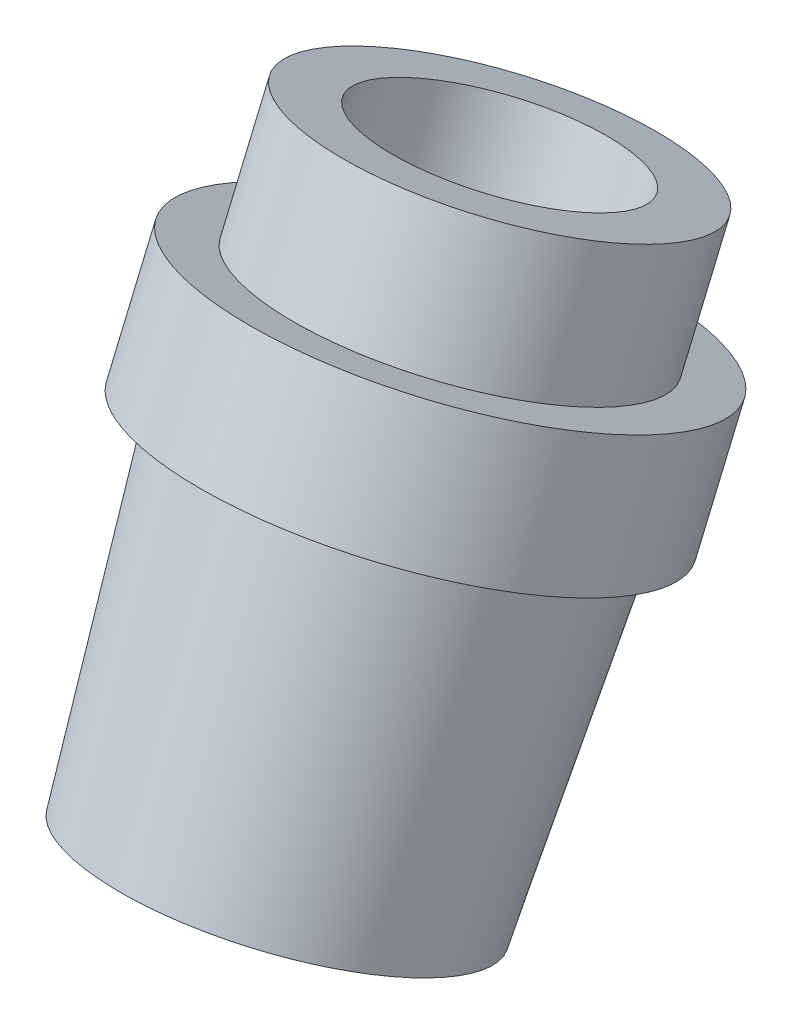
ISO-10303-21;
HEADER;
FILE_DESCRIPTION(('STEP AP214'),'2;1');
FILE_NAME('part.step','',(''),(''),'','','');
FILE_SCHEMA(('AUTOMOTIVE_DESIGN { 1 0 10303 214 1 1 1 1 }'));
ENDSEC;
DATA;
#1=APPLICATION_CONTEXT('core data for automotive mechanical design processes');
#2=APPLICATION_PROTOCOL_DEFINITION('international standard','automotive_design',2000,#1);
#3=PRODUCT_CONTEXT('',#1,'mechanical');
#4=PRODUCT('Part','Part','',(#3));
#5=PRODUCT_RELATED_PRODUCT_CATEGORY('part','',(#4));
#6=PRODUCT_DEFINITION_FORMATION('','',#4);
#7=PRODUCT_DEFINITION_CONTEXT('part definition',#1,'design');
#8=PRODUCT_DEFINITION('design','',#6,#7);
#9=PRODUCT_DEFINITION_SHAPE('','',#8);
#10=(LENGTH_UNIT() NAMED_UNIT(*) SI_UNIT(.MILLI.,.METRE.));
#11=(NAMED_UNIT(*) PLANE_ANGLE_UNIT() SI_UNIT($,.RADIAN.));
#12=(NAMED_UNIT(*) SI_UNIT($,.STERADIAN.) SOLID_ANGLE_UNIT());
#13=UNCERTAINTY_MEASURE_WITH_UNIT(LENGTH_MEASURE(1.E-05),#10,'distance_accuracy_value','');
#14=(GEOMETRIC_REPRESENTATION_CONTEXT(3) GLOBAL_UNCERTAINTY_ASSIGNED_CONTEXT((#13)) GLOBAL_UNIT_ASSIGNED_CONTEXT((#10,
#11,#12)) REPRESENTATION_CONTEXT('',''));
#15=CARTESIAN_POINT('',(0.,0.,0.));
#16=DIRECTION('',(0.,0.,1.));
#17=DIRECTION('',(1.,0.,0.));
#18=AXIS2_PLACEMENT_3D('',#15,#16,#17);
#19=CARTESIAN_POINT('',(-1.81784857534822E-12,-204.304483063694,348.49114350528));
#20=DIRECTION('',(0.,-0.920504853452441,0.390731128489271));
#21=DIRECTION('',(0.,-0.390731128489271,-0.920504853452441));
#22=AXIS2_PLACEMENT_3D('',#19,#20,#21);
#23=PLANE('',#22);
#24=CARTESIAN_POINT('',(-1.81784857534822E-12,-204.304483063694,348.49114350528));
#25=DIRECTION('',(0.,-0.920504853452441,0.390731128489271));
#26=DIRECTION('',(0.,-0.390731128489271,-0.920504853452441));
#27=AXIS2_PLACEMENT_3D('',#24,#25,#26);
#28=CIRCLE('',#27,34.3930374945528);
#29=CARTESIAN_POINT('',(-1.81784857534822E-12,-217.742913416114,316.832185566572));
#30=VERTEX_POINT('',#29);
#31=EDGE_CURVE('E58',#30,#30,#28,.T.);
#32=ORIENTED_EDGE('',*,*,#31,.T.);
#33=EDGE_LOOP('',(#32));
#34=FACE_BOUND('',#33,.T.);
#35=CARTESIAN_POINT('',(-1.81784857534822E-12,-204.304483063694,348.49114350528));
#36=DIRECTION('',(0.,-0.920504853452441,0.390731128489271));
#37=DIRECTION('',(0.,-0.390731128489271,-0.920504853452441));
#38=AXIS2_PLACEMENT_3D('',#35,#36,#37);
#39=CIRCLE('',#38,29.5134264587048);
#40=CARTESIAN_POINT('',(-1.81784857534822E-12,-215.836297489489,321.32389120803));
#41=VERTEX_POINT('',#40);
#42=EDGE_CURVE('E43',#41,#41,#39,.T.);
#43=ORIENTED_EDGE('',*,*,#42,.F.);
#44=EDGE_LOOP('',(#43));
#45=FACE_BOUND('',#44,.T.);
#46=ADVANCED_FACE('F39',(#34,#45),#23,.T.);
#47=CARTESIAN_POINT('',(-2.46797192531776E-12,-255.912584649944,370.39748294103));
#48=DIRECTION('',(0.,0.920504853452441,-0.390731128489271));
#49=DIRECTION('',(0.,0.390731128489271,0.920504853452441));
#50=AXIS2_PLACEMENT_3D('',#47,#48,#49);
#51=CYLINDRICAL_SURFACE('',#50,26.8930374945528);
#52=CARTESIAN_POINT('',(-1.35401310719827E-12,-167.484288925596,332.861898365709));
#53=DIRECTION('',(0.,-0.920504853452441,0.390731128489271));
#54=DIRECTION('',(0.,-0.390731128489271,-0.920504853452441));
#55=AXIS2_PLACEMENT_3D('',#52,#53,#54);
#56=CIRCLE('',#55,26.8930374945528);
#57=CARTESIAN_POINT('',(-1.35401310719827E-12,-177.992235814347,308.106726827895));
#58=VERTEX_POINT('',#57);
#59=EDGE_CURVE('E47',#58,#58,#56,.T.);
#60=ORIENTED_EDGE('',*,*,#59,.T.);
#61=EDGE_LOOP('',(#60));
#62=FACE_BOUND('',#61,.T.);
#63=CARTESIAN_POINT('',(-1.58593084127324E-12,-185.894385994645,340.676520935495));
#64=DIRECTION('',(0.,-0.920504853452441,0.390731128489271));
#65=DIRECTION('',(0.,-0.390731128489271,-0.920504853452441));
#66=AXIS2_PLACEMENT_3D('',#63,#64,#65);
#67=CIRCLE('',#66,26.8930374945528);
#68=CARTESIAN_POINT('',(-1.58593084127324E-12,-196.402332883396,315.92134939768));
#69=VERTEX_POINT('',#68);
#70=EDGE_CURVE('E10',#69,#69,#67,.T.);
#71=ORIENTED_EDGE('',*,*,#70,.F.);
#72=EDGE_LOOP('',(#71));
#73=FACE_BOUND('',#72,.T.);
#74=ADVANCED_FACE('F78',(#62,#73),#51,.T.);
#75=CARTESIAN_POINT('',(-1.35401310719827E-12,-167.484288925596,332.861898365709));
#76=DIRECTION('',(0.,-0.920504853452441,0.390731128489271));
#77=DIRECTION('',(0.,-0.390731128489271,-0.920504853452441));
#78=AXIS2_PLACEMENT_3D('',#75,#76,#77);
#79=PLANE('',#78);
#80=ORIENTED_EDGE('',*,*,#59,.F.);
#81=EDGE_LOOP('',(#80));
#82=FACE_BOUND('',#81,.T.);
#83=CARTESIAN_POINT('',(-1.35401310719827E-12,-167.484288925596,332.861898365709));
#84=DIRECTION('',(0.,-0.920504853452441,0.390731128489271));
#85=DIRECTION('',(0.,-0.390731128489271,-0.920504853452441));
#86=AXIS2_PLACEMENT_3D('',#83,#84,#85);
#87=CIRCLE('',#86,18.393037494553);
#88=CARTESIAN_POINT('',(-1.35401310719827E-12,-174.671021222188,315.93101808224));
#89=VERTEX_POINT('',#88);
#90=EDGE_CURVE('E52',#89,#89,#87,.T.);
#91=ORIENTED_EDGE('',*,*,#90,.T.);
#92=EDGE_LOOP('',(#91));
#93=FACE_BOUND('',#92,.T.);
#94=ADVANCED_FACE('F84',(#82,#93),#79,.F.);
#95=CARTESIAN_POINT('',(-2.46797192531776E-12,-255.912584649944,370.39748294103));
#96=DIRECTION('',(0.,0.920504853452441,-0.390731128489271));
#97=DIRECTION('',(0.,0.390731128489271,0.920504853452441));
#98=AXIS2_PLACEMENT_3D('',#95,#96,#97);
#99=CYLINDRICAL_SURFACE('',#98,18.393037494553);
#100=ORIENTED_EDGE('',*,*,#90,.F.);
#101=EDGE_LOOP('',(#100));
#102=FACE_BOUND('',#101,.T.);
#103=CARTESIAN_POINT('',(-2.39764291053566E-12,-250.329725736316,368.027699929744));
#104=DIRECTION('',(0.,-0.920504853452441,0.390731128489271));
#105=DIRECTION('',(0.,-0.390731128489271,-0.920504853452441));
#106=AXIS2_PLACEMENT_3D('',#103,#104,#105);
#107=CIRCLE('',#106,18.393037494553);
#108=CARTESIAN_POINT('',(-2.39764291053566E-12,-257.516458032908,351.096819646275));
#109=VERTEX_POINT('',#108);
#110=EDGE_CURVE('E69',#109,#109,#107,.T.);
#111=ORIENTED_EDGE('',*,*,#110,.T.);
#112=EDGE_LOOP('',(#111));
#113=FACE_BOUND('',#112,.T.);
#114=ADVANCED_FACE('F93',(#102,#113),#99,.F.);
#115=CARTESIAN_POINT('',(-1.58593084127324E-12,-185.894385994645,340.676520935495));
#116=DIRECTION('',(0.,-0.920504853452441,0.390731128489271));
#117=DIRECTION('',(0.,-0.390731128489271,-0.920504853452441));
#118=AXIS2_PLACEMENT_3D('',#115,#116,#117);
#119=PLANE('',#118);
#120=ORIENTED_EDGE('',*,*,#70,.T.);
#121=EDGE_LOOP('',(#120));
#122=FACE_BOUND('',#121,.T.);
#123=CARTESIAN_POINT('',(-1.58593084127324E-12,-185.894385994645,340.676520935495));
#124=DIRECTION('',(0.,-0.920504853452441,0.390731128489271));
#125=DIRECTION('',(0.,-0.390731128489271,-0.920504853452441));
#126=AXIS2_PLACEMENT_3D('',#123,#124,#125);
#127=CIRCLE('',#126,34.3930374945528);
#128=CARTESIAN_POINT('',(-1.58593084127324E-12,-199.332816347066,309.017562996787));
#129=VERTEX_POINT('',#128);
#130=EDGE_CURVE('E55',#129,#129,#127,.T.);
#131=ORIENTED_EDGE('',*,*,#130,.F.);
#132=EDGE_LOOP('',(#131));
#133=FACE_BOUND('',#132,.T.);
#134=ADVANCED_FACE('F89',(#122,#133),#119,.F.);
#135=CARTESIAN_POINT('',(-1.81784857534822E-12,-204.304483063694,348.49114350528));
#136=DIRECTION('',(0.,0.920504853452441,-0.390731128489271));
#137=DIRECTION('',(0.,0.390731128489271,0.920504853452441));
#138=AXIS2_PLACEMENT_3D('',#135,#136,#137);
#139=CYLINDRICAL_SURFACE('',#138,34.3930374945528);
#140=ORIENTED_EDGE('',*,*,#31,.F.);
#141=EDGE_LOOP('',(#140));
#142=FACE_BOUND('',#141,.T.);
#143=ORIENTED_EDGE('',*,*,#130,.T.);
#144=EDGE_LOOP('',(#143));
#145=FACE_BOUND('',#144,.T.);
#146=ADVANCED_FACE('F92',(#142,#145),#139,.T.);
#147=CARTESIAN_POINT('',(-2.39764291053566E-12,-250.329725736316,368.027699929744));
#148=DIRECTION('',(0.,-0.920504853452441,0.390731128489271));
#149=DIRECTION('',(0.,-0.390731128489271,-0.920504853452441));
#150=AXIS2_PLACEMENT_3D('',#147,#148,#149);
#151=PLANE('',#150);
#152=CARTESIAN_POINT('',(-2.39764291053566E-12,-250.329725736316,368.027699929744));
#153=DIRECTION('',(0.,-0.920504853452441,0.390731128489271));
#154=DIRECTION('',(0.,-0.390731128489271,-0.920504853452441));
#155=AXIS2_PLACEMENT_3D('',#152,#153,#154);
#156=CIRCLE('',#155,26.8930374945528);
#157=CARTESIAN_POINT('',(-2.39764291053566E-12,-260.837672625067,343.272528391929));
#158=VERTEX_POINT('',#157);
#159=EDGE_CURVE('E65',#158,#158,#156,.T.);
#160=ORIENTED_EDGE('',*,*,#159,.T.);
#161=EDGE_LOOP('',(#160));
#162=FACE_BOUND('',#161,.T.);
#163=ORIENTED_EDGE('',*,*,#110,.F.);
#164=EDGE_LOOP('',(#163));
#165=FACE_BOUND('',#164,.T.);
#166=ADVANCED_FACE('F88',(#162,#165),#151,.T.);
#167=CARTESIAN_POINT('',(-2.39764291053566E-12,-250.329725736316,368.027699929744));
#168=DIRECTION('',(0.,0.920504853452441,-0.390731128489271));
#169=DIRECTION('',(0.,-0.390731128489271,-0.920504853452441));
#170=AXIS2_PLACEMENT_3D('',#167,#168,#169);
#171=CONICAL_SURFACE('',#170,26.8930374945528,0.05235987755983);
#172=ORIENTED_EDGE('',*,*,#159,.F.);
#173=EDGE_LOOP('',(#172));
#174=FACE_BOUND('',#173,.T.);
#175=ORIENTED_EDGE('',*,*,#42,.T.);
#176=EDGE_LOOP('',(#175));
#177=FACE_BOUND('',#176,.T.);
#178=ADVANCED_FACE('F41',(#174,#177),#171,.T.);
#179=CLOSED_SHELL('',(#46,#74,#94,#114,#134,#146,#166,#178));
#180=MANIFOLD_SOLID_BREP('B2',#179);
#181=ADVANCED_BREP_SHAPE_REPRESENTATION('',(#18,#180),#14);
#182=SHAPE_DEFINITION_REPRESENTATION(#9,#181);
ENDSEC;
END-ISO-10303-21;
